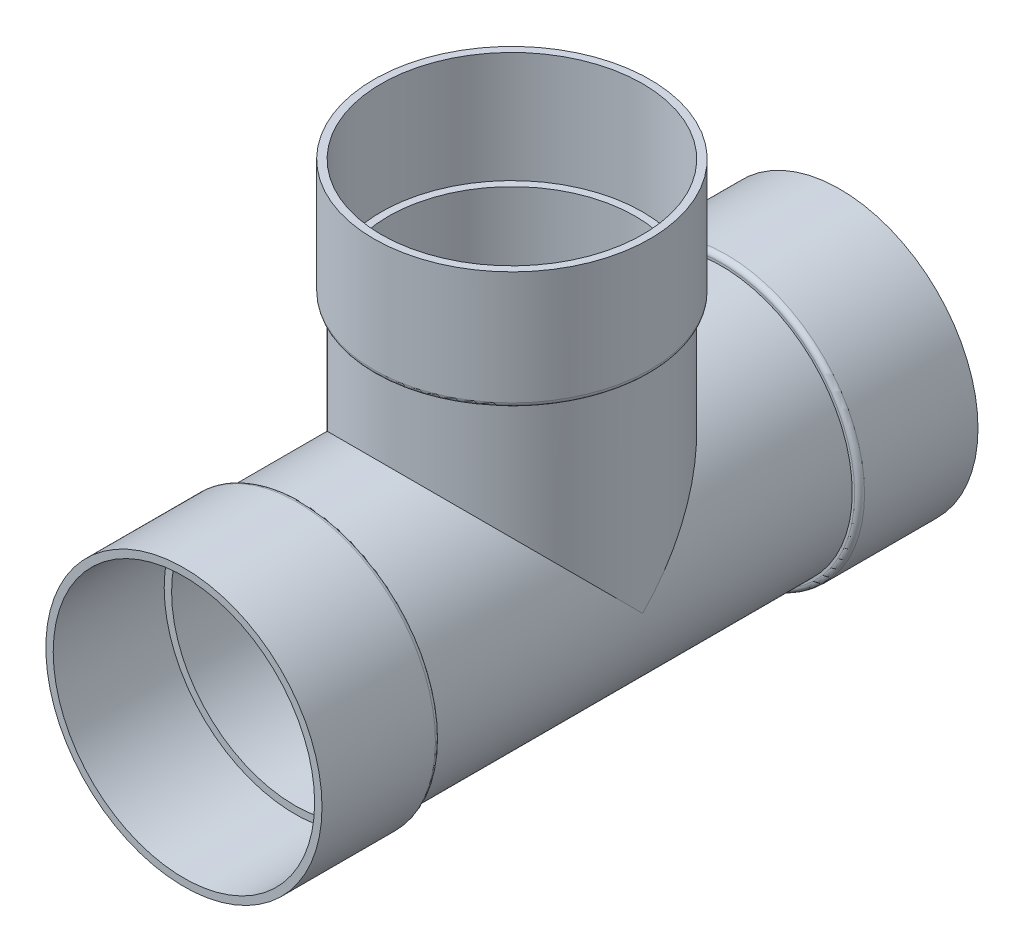
ISO-10303-21;
HEADER;
FILE_DESCRIPTION(('STEP AP214'),'2;1');
FILE_NAME('part.step','',(''),(''),'','','');
FILE_SCHEMA(('AUTOMOTIVE_DESIGN { 1 0 10303 214 1 1 1 1 }'));
ENDSEC;
DATA;
#1=APPLICATION_CONTEXT('core data for automotive mechanical design processes');
#2=APPLICATION_PROTOCOL_DEFINITION('international standard','automotive_design',2000,#1);
#3=PRODUCT_CONTEXT('',#1,'mechanical');
#4=PRODUCT('Part','Part','',(#3));
#5=PRODUCT_RELATED_PRODUCT_CATEGORY('part','',(#4));
#6=PRODUCT_DEFINITION_FORMATION('','',#4);
#7=PRODUCT_DEFINITION_CONTEXT('part definition',#1,'design');
#8=PRODUCT_DEFINITION('design','',#6,#7);
#9=PRODUCT_DEFINITION_SHAPE('','',#8);
#10=(LENGTH_UNIT() NAMED_UNIT(*) SI_UNIT(.MILLI.,.METRE.));
#11=(NAMED_UNIT(*) PLANE_ANGLE_UNIT() SI_UNIT($,.RADIAN.));
#12=(NAMED_UNIT(*) SI_UNIT($,.STERADIAN.) SOLID_ANGLE_UNIT());
#13=UNCERTAINTY_MEASURE_WITH_UNIT(LENGTH_MEASURE(1.E-05),#10,'distance_accuracy_value','');
#14=(GEOMETRIC_REPRESENTATION_CONTEXT(3) GLOBAL_UNCERTAINTY_ASSIGNED_CONTEXT((#13)) GLOBAL_UNIT_ASSIGNED_CONTEXT((#10,
#11,#12)) REPRESENTATION_CONTEXT('',''));
#15=CARTESIAN_POINT('',(0.,0.,0.));
#16=DIRECTION('',(0.,0.,1.));
#17=DIRECTION('',(1.,0.,0.));
#18=AXIS2_PLACEMENT_3D('',#15,#16,#17);
#19=CARTESIAN_POINT('',(0.,0.,211.1375));
#20=DIRECTION('',(0.,0.,-1.));
#21=DIRECTION('',(-1.,0.,0.));
#22=AXIS2_PLACEMENT_3D('',#19,#20,#21);
#23=PLANE('',#22);
#24=CARTESIAN_POINT('',(0.,0.,211.1375));
#25=DIRECTION('',(0.,0.,-1.));
#26=DIRECTION('',(-1.,0.,0.));
#27=AXIS2_PLACEMENT_3D('',#24,#25,#26);
#28=CIRCLE('',#27,84.1375);
#29=CARTESIAN_POINT('',(-84.1375,0.,211.1375));
#30=VERTEX_POINT('',#29);
#31=EDGE_CURVE('E243',#30,#30,#28,.F.);
#32=ORIENTED_EDGE('',*,*,#31,.F.);
#33=EDGE_LOOP('',(#32));
#34=FACE_BOUND('',#33,.T.);
#35=CARTESIAN_POINT('',(0.,0.,211.1375));
#36=DIRECTION('',(0.,0.,1.));
#37=DIRECTION('',(1.,0.,0.));
#38=AXIS2_PLACEMENT_3D('',#35,#36,#37);
#39=CIRCLE('',#38,88.8873);
#40=CARTESIAN_POINT('',(88.8873,0.,211.1375));
#41=VERTEX_POINT('',#40);
#42=EDGE_CURVE('E300',#41,#41,#39,.T.);
#43=ORIENTED_EDGE('',*,*,#42,.T.);
#44=EDGE_LOOP('',(#43));
#45=FACE_BOUND('',#44,.T.);
#46=ADVANCED_FACE('F203',(#34,#45),#23,.F.);
#47=CARTESIAN_POINT('',(0.,0.,168.70511138535));
#48=DIRECTION('',(0.,0.,1.));
#49=DIRECTION('',(1.,0.,0.));
#50=AXIS2_PLACEMENT_3D('',#47,#48,#49);
#51=CYLINDRICAL_SURFACE('',#50,88.8873);
#52=CARTESIAN_POINT('',(0.,0.,138.1125));
#53=DIRECTION('',(0.,0.,1.));
#54=DIRECTION('',(1.,0.,0.));
#55=AXIS2_PLACEMENT_3D('',#52,#53,#54);
#56=CIRCLE('',#55,88.8873);
#57=CARTESIAN_POINT('',(88.8873,0.,138.1125));
#58=VERTEX_POINT('',#57);
#59=EDGE_CURVE('E316',#58,#58,#56,.T.);
#60=ORIENTED_EDGE('',*,*,#59,.T.);
#61=EDGE_LOOP('',(#60));
#62=FACE_BOUND('',#61,.T.);
#63=ORIENTED_EDGE('',*,*,#42,.F.);
#64=EDGE_LOOP('',(#63));
#65=FACE_BOUND('',#64,.T.);
#66=ADVANCED_FACE('F341',(#62,#65),#51,.T.);
#67=CARTESIAN_POINT('',(0.,88.8873,134.9375));
#68=DIRECTION('',(0.,0.,1.));
#69=DIRECTION('',(1.,0.,0.));
#70=AXIS2_PLACEMENT_3D('',#67,#68,#69);
#71=PLANE('',#70);
#72=CARTESIAN_POINT('',(0.,0.,134.9375));
#73=DIRECTION('',(0.,0.,1.));
#74=DIRECTION('',(1.,0.,0.));
#75=AXIS2_PLACEMENT_3D('',#72,#73,#74);
#76=CIRCLE('',#75,85.7123);
#77=CARTESIAN_POINT('',(85.7123,0.,134.9375));
#78=VERTEX_POINT('',#77);
#79=EDGE_CURVE('E320',#78,#78,#76,.F.);
#80=ORIENTED_EDGE('',*,*,#79,.T.);
#81=EDGE_LOOP('',(#80));
#82=FACE_BOUND('',#81,.T.);
#83=CARTESIAN_POINT('',(0.,0.,134.9375));
#84=DIRECTION('',(0.,0.,1.));
#85=DIRECTION('',(1.,0.,0.));
#86=AXIS2_PLACEMENT_3D('',#83,#84,#85);
#87=CIRCLE('',#86,84.1375);
#88=CARTESIAN_POINT('',(84.1375,0.,134.9375));
#89=VERTEX_POINT('',#88);
#90=EDGE_CURVE('E296',#89,#89,#87,.T.);
#91=ORIENTED_EDGE('',*,*,#90,.T.);
#92=EDGE_LOOP('',(#91));
#93=FACE_BOUND('',#92,.T.);
#94=ADVANCED_FACE('F347',(#82,#93),#71,.F.);
#95=CARTESIAN_POINT('',(0.,0.,168.70511138535));
#96=DIRECTION('',(0.,0.,1.));
#97=DIRECTION('',(1.,0.,0.));
#98=AXIS2_PLACEMENT_3D('',#95,#96,#97);
#99=CYLINDRICAL_SURFACE('',#98,84.1375);
#100=CARTESIAN_POINT('',(0.,0.,0.));
#101=DIRECTION('',(0.,-0.707106781186547,0.707106781186547));
#102=DIRECTION('',(0.,0.707106781186547,0.707106781186547));
#103=AXIS2_PLACEMENT_3D('',#100,#101,#102);
#104=ELLIPSE('',#103,118.988393604166,84.1375);
#105=CARTESIAN_POINT('',(84.1375,0.,0.));
#106=VERTEX_POINT('',#105);
#107=CARTESIAN_POINT('',(-84.1375,0.,0.));
#108=VERTEX_POINT('',#107);
#109=EDGE_CURVE('E226',#106,#108,#104,.T.);
#110=ORIENTED_EDGE('',*,*,#109,.T.);
#111=CARTESIAN_POINT('',(0.,0.,0.));
#112=DIRECTION('',(0.,0.707106781186547,0.707106781186547));
#113=DIRECTION('',(0.,-0.707106781186547,0.707106781186547));
#114=AXIS2_PLACEMENT_3D('',#111,#112,#113);
#115=ELLIPSE('',#114,118.988393604166,84.1375);
#116=EDGE_CURVE('E221',#108,#106,#115,.F.);
#117=ORIENTED_EDGE('',*,*,#116,.T.);
#118=EDGE_LOOP('',(#110,#117));
#119=FACE_BOUND('',#118,.T.);
#120=ORIENTED_EDGE('',*,*,#90,.F.);
#121=EDGE_LOOP('',(#120));
#122=FACE_BOUND('',#121,.T.);
#123=CARTESIAN_POINT('',(0.,0.,-134.9375));
#124=DIRECTION('',(0.,0.,1.));
#125=DIRECTION('',(1.,0.,0.));
#126=AXIS2_PLACEMENT_3D('',#123,#124,#125);
#127=CIRCLE('',#126,84.1375);
#128=CARTESIAN_POINT('',(84.1375,0.,-134.9375));
#129=VERTEX_POINT('',#128);
#130=EDGE_CURVE('E292',#129,#129,#127,.T.);
#131=ORIENTED_EDGE('',*,*,#130,.T.);
#132=EDGE_LOOP('',(#131));
#133=FACE_BOUND('',#132,.T.);
#134=ADVANCED_FACE('F371',(#119,#122,#133),#99,.T.);
#135=CARTESIAN_POINT('',(0.,88.8873,-134.9375));
#136=DIRECTION('',(0.,0.,-1.));
#137=DIRECTION('',(-1.,0.,0.));
#138=AXIS2_PLACEMENT_3D('',#135,#136,#137);
#139=PLANE('',#138);
#140=CARTESIAN_POINT('',(0.,0.,-134.9375));
#141=DIRECTION('',(0.,0.,-1.));
#142=DIRECTION('',(-1.,0.,0.));
#143=AXIS2_PLACEMENT_3D('',#140,#141,#142);
#144=CIRCLE('',#143,85.7123);
#145=CARTESIAN_POINT('',(-85.7123,0.,-134.9375));
#146=VERTEX_POINT('',#145);
#147=EDGE_CURVE('E308',#146,#146,#144,.F.);
#148=ORIENTED_EDGE('',*,*,#147,.T.);
#149=EDGE_LOOP('',(#148));
#150=FACE_BOUND('',#149,.T.);
#151=ORIENTED_EDGE('',*,*,#130,.F.);
#152=EDGE_LOOP('',(#151));
#153=FACE_BOUND('',#152,.T.);
#154=ADVANCED_FACE('F367',(#150,#153),#139,.F.);
#155=CARTESIAN_POINT('',(0.,0.,168.70511138535));
#156=DIRECTION('',(0.,0.,1.));
#157=DIRECTION('',(1.,0.,0.));
#158=AXIS2_PLACEMENT_3D('',#155,#156,#157);
#159=CYLINDRICAL_SURFACE('',#158,88.8873);
#160=CARTESIAN_POINT('',(0.,0.,-138.1125));
#161=DIRECTION('',(0.,0.,-1.));
#162=DIRECTION('',(-1.,0.,0.));
#163=AXIS2_PLACEMENT_3D('',#160,#161,#162);
#164=CIRCLE('',#163,88.8873);
#165=CARTESIAN_POINT('',(-88.8873,0.,-138.1125));
#166=VERTEX_POINT('',#165);
#167=EDGE_CURVE('E312',#166,#166,#164,.T.);
#168=ORIENTED_EDGE('',*,*,#167,.T.);
#169=EDGE_LOOP('',(#168));
#170=FACE_BOUND('',#169,.T.);
#171=CARTESIAN_POINT('',(0.,0.,-211.1375));
#172=DIRECTION('',(0.,0.,1.));
#173=DIRECTION('',(1.,0.,0.));
#174=AXIS2_PLACEMENT_3D('',#171,#172,#173);
#175=CIRCLE('',#174,88.8873);
#176=CARTESIAN_POINT('',(88.8873,0.,-211.1375));
#177=VERTEX_POINT('',#176);
#178=EDGE_CURVE('E288',#177,#177,#175,.T.);
#179=ORIENTED_EDGE('',*,*,#178,.T.);
#180=EDGE_LOOP('',(#179));
#181=FACE_BOUND('',#180,.T.);
#182=ADVANCED_FACE('F370',(#170,#181),#159,.T.);
#183=CARTESIAN_POINT('',(0.,88.8873,-211.1375));
#184=DIRECTION('',(0.,0.,1.));
#185=DIRECTION('',(1.,0.,0.));
#186=AXIS2_PLACEMENT_3D('',#183,#184,#185);
#187=PLANE('',#186);
#188=CARTESIAN_POINT('',(0.,0.,-211.1375));
#189=DIRECTION('',(0.,0.,1.));
#190=DIRECTION('',(1.,0.,0.));
#191=AXIS2_PLACEMENT_3D('',#188,#189,#190);
#192=CIRCLE('',#191,84.1375);
#193=CARTESIAN_POINT('',(84.1375,0.,-211.1375));
#194=VERTEX_POINT('',#193);
#195=EDGE_CURVE('E265',#194,#194,#192,.T.);
#196=ORIENTED_EDGE('',*,*,#195,.T.);
#197=EDGE_LOOP('',(#196));
#198=FACE_BOUND('',#197,.T.);
#199=ORIENTED_EDGE('',*,*,#178,.F.);
#200=EDGE_LOOP('',(#199));
#201=FACE_BOUND('',#200,.T.);
#202=ADVANCED_FACE('F386',(#198,#201),#187,.F.);
#203=CARTESIAN_POINT('',(0.,0.,0.));
#204=DIRECTION('',(0.,1.,0.));
#205=DIRECTION('',(0.,0.,1.));
#206=AXIS2_PLACEMENT_3D('',#203,#204,#205);
#207=CYLINDRICAL_SURFACE('',#206,84.1375);
#208=CARTESIAN_POINT('',(0.,134.9375,0.));
#209=DIRECTION('',(0.,1.,0.));
#210=DIRECTION('',(0.,0.,1.));
#211=AXIS2_PLACEMENT_3D('',#208,#209,#210);
#212=CIRCLE('',#211,84.1375);
#213=CARTESIAN_POINT('',(0.,134.9375,84.1375));
#214=VERTEX_POINT('',#213);
#215=EDGE_CURVE('E247',#214,#214,#212,.T.);
#216=ORIENTED_EDGE('',*,*,#215,.F.);
#217=EDGE_LOOP('',(#216));
#218=FACE_BOUND('',#217,.T.);
#219=ORIENTED_EDGE('',*,*,#116,.F.);
#220=ORIENTED_EDGE('',*,*,#109,.F.);
#221=EDGE_LOOP('',(#219,#220));
#222=FACE_BOUND('',#221,.T.);
#223=ADVANCED_FACE('F390',(#218,#222),#207,.T.);
#224=CARTESIAN_POINT('',(0.,211.1375,0.));
#225=DIRECTION('',(0.,1.,0.));
#226=DIRECTION('',(0.,0.,1.));
#227=AXIS2_PLACEMENT_3D('',#224,#225,#226);
#228=PLANE('',#227);
#229=CARTESIAN_POINT('',(0.,211.1375,0.));
#230=DIRECTION('',(0.,1.,0.));
#231=DIRECTION('',(0.,0.,1.));
#232=AXIS2_PLACEMENT_3D('',#229,#230,#231);
#233=CIRCLE('',#232,84.1375);
#234=CARTESIAN_POINT('',(0.,211.1375,84.1375));
#235=VERTEX_POINT('',#234);
#236=EDGE_CURVE('E274',#235,#235,#233,.T.);
#237=ORIENTED_EDGE('',*,*,#236,.F.);
#238=EDGE_LOOP('',(#237));
#239=FACE_BOUND('',#238,.T.);
#240=CARTESIAN_POINT('',(0.,211.1375,0.));
#241=DIRECTION('',(0.,1.,0.));
#242=DIRECTION('',(0.,0.,1.));
#243=AXIS2_PLACEMENT_3D('',#240,#241,#242);
#244=CIRCLE('',#243,88.8873);
#245=CARTESIAN_POINT('',(0.,211.1375,88.8873));
#246=VERTEX_POINT('',#245);
#247=EDGE_CURVE('E252',#246,#246,#244,.T.);
#248=ORIENTED_EDGE('',*,*,#247,.T.);
#249=EDGE_LOOP('',(#248));
#250=FACE_BOUND('',#249,.T.);
#251=ADVANCED_FACE('F392',(#239,#250),#228,.T.);
#252=CARTESIAN_POINT('',(0.,0.,0.));
#253=DIRECTION('',(0.,1.,0.));
#254=DIRECTION('',(0.,0.,1.));
#255=AXIS2_PLACEMENT_3D('',#252,#253,#254);
#256=CYLINDRICAL_SURFACE('',#255,88.8873);
#257=CARTESIAN_POINT('',(0.,138.1125,0.));
#258=DIRECTION('',(0.,-1.,0.));
#259=DIRECTION('',(0.,0.,-1.));
#260=AXIS2_PLACEMENT_3D('',#257,#258,#259);
#261=CIRCLE('',#260,88.8873);
#262=CARTESIAN_POINT('',(0.,138.1125,-88.8873));
#263=VERTEX_POINT('',#262);
#264=EDGE_CURVE('E212',#263,#263,#261,.F.);
#265=ORIENTED_EDGE('',*,*,#264,.T.);
#266=EDGE_LOOP('',(#265));
#267=FACE_BOUND('',#266,.T.);
#268=ORIENTED_EDGE('',*,*,#247,.F.);
#269=EDGE_LOOP('',(#268));
#270=FACE_BOUND('',#269,.T.);
#271=ADVANCED_FACE('F328',(#267,#270),#256,.T.);
#272=CARTESIAN_POINT('',(0.,134.9375,88.8873));
#273=DIRECTION('',(0.,-1.,0.));
#274=DIRECTION('',(0.,0.,-1.));
#275=AXIS2_PLACEMENT_3D('',#272,#273,#274);
#276=PLANE('',#275);
#277=CARTESIAN_POINT('',(0.,134.9375,0.));
#278=DIRECTION('',(0.,-1.,0.));
#279=DIRECTION('',(0.,0.,-1.));
#280=AXIS2_PLACEMENT_3D('',#277,#278,#279);
#281=CIRCLE('',#280,85.7123);
#282=CARTESIAN_POINT('',(0.,134.9375,-85.7123));
#283=VERTEX_POINT('',#282);
#284=EDGE_CURVE('E14',#283,#283,#281,.T.);
#285=ORIENTED_EDGE('',*,*,#284,.T.);
#286=EDGE_LOOP('',(#285));
#287=FACE_BOUND('',#286,.T.);
#288=ORIENTED_EDGE('',*,*,#215,.T.);
#289=EDGE_LOOP('',(#288));
#290=FACE_BOUND('',#289,.T.);
#291=ADVANCED_FACE('F398',(#287,#290),#276,.T.);
#292=CARTESIAN_POINT('',(0.,0.,168.70511138535));
#293=DIRECTION('',(0.,0.,1.));
#294=DIRECTION('',(1.,0.,0.));
#295=AXIS2_PLACEMENT_3D('',#292,#293,#294);
#296=CYLINDRICAL_SURFACE('',#295,84.1375);
#297=ORIENTED_EDGE('',*,*,#31,.T.);
#298=EDGE_LOOP('',(#297));
#299=FACE_BOUND('',#298,.T.);
#300=CARTESIAN_POINT('',(0.,0.,139.6873));
#301=DIRECTION('',(0.,0.,1.));
#302=DIRECTION('',(1.,0.,0.));
#303=AXIS2_PLACEMENT_3D('',#300,#301,#302);
#304=CIRCLE('',#303,84.1375);
#305=CARTESIAN_POINT('',(84.1375,0.,139.6873));
#306=VERTEX_POINT('',#305);
#307=EDGE_CURVE('E278',#306,#306,#304,.T.);
#308=ORIENTED_EDGE('',*,*,#307,.F.);
#309=EDGE_LOOP('',(#308));
#310=FACE_BOUND('',#309,.T.);
#311=ADVANCED_FACE('F401',(#299,#310),#296,.F.);
#312=CARTESIAN_POINT('',(0.,88.8873,139.6873));
#313=DIRECTION('',(0.,0.,1.));
#314=DIRECTION('',(1.,0.,0.));
#315=AXIS2_PLACEMENT_3D('',#312,#313,#314);
#316=PLANE('',#315);
#317=ORIENTED_EDGE('',*,*,#307,.T.);
#318=EDGE_LOOP('',(#317));
#319=FACE_BOUND('',#318,.T.);
#320=CARTESIAN_POINT('',(0.,0.,139.6873));
#321=DIRECTION('',(0.,0.,1.));
#322=DIRECTION('',(1.,0.,0.));
#323=AXIS2_PLACEMENT_3D('',#320,#321,#322);
#324=CIRCLE('',#323,79.3877);
#325=CARTESIAN_POINT('',(79.3877,0.,139.6873));
#326=VERTEX_POINT('',#325);
#327=EDGE_CURVE('E260',#326,#326,#324,.T.);
#328=ORIENTED_EDGE('',*,*,#327,.F.);
#329=EDGE_LOOP('',(#328));
#330=FACE_BOUND('',#329,.T.);
#331=ADVANCED_FACE('F422',(#319,#330),#316,.T.);
#332=CARTESIAN_POINT('',(0.,0.,168.70511138535));
#333=DIRECTION('',(0.,0.,1.));
#334=DIRECTION('',(1.,0.,0.));
#335=AXIS2_PLACEMENT_3D('',#332,#333,#334);
#336=CYLINDRICAL_SURFACE('',#335,79.3877);
#337=CARTESIAN_POINT('',(0.,0.,0.));
#338=DIRECTION('',(0.,-0.707106781186547,0.707106781186547));
#339=DIRECTION('',(0.,0.707106781186547,0.707106781186547));
#340=AXIS2_PLACEMENT_3D('',#337,#338,#339);
#341=ELLIPSE('',#340,112.271162025607,79.3877);
#342=CARTESIAN_POINT('',(79.3877,0.,0.));
#343=VERTEX_POINT('',#342);
#344=CARTESIAN_POINT('',(-79.3877,0.,0.));
#345=VERTEX_POINT('',#344);
#346=EDGE_CURVE('E236',#343,#345,#341,.T.);
#347=ORIENTED_EDGE('',*,*,#346,.F.);
#348=CARTESIAN_POINT('',(0.,0.,0.));
#349=DIRECTION('',(0.,0.707106781186547,0.707106781186547));
#350=DIRECTION('',(0.,-0.707106781186547,0.707106781186547));
#351=AXIS2_PLACEMENT_3D('',#348,#349,#350);
#352=ELLIPSE('',#351,112.271162025607,79.3877);
#353=EDGE_CURVE('E240',#345,#343,#352,.F.);
#354=ORIENTED_EDGE('',*,*,#353,.F.);
#355=EDGE_LOOP('',(#347,#354));
#356=FACE_BOUND('',#355,.T.);
#357=ORIENTED_EDGE('',*,*,#327,.T.);
#358=EDGE_LOOP('',(#357));
#359=FACE_BOUND('',#358,.T.);
#360=CARTESIAN_POINT('',(0.,0.,-139.6873));
#361=DIRECTION('',(0.,0.,-1.));
#362=DIRECTION('',(-1.,0.,0.));
#363=AXIS2_PLACEMENT_3D('',#360,#361,#362);
#364=CIRCLE('',#363,79.3877);
#365=CARTESIAN_POINT('',(-79.3877,0.,-139.6873));
#366=VERTEX_POINT('',#365);
#367=EDGE_CURVE('E256',#366,#366,#364,.F.);
#368=ORIENTED_EDGE('',*,*,#367,.F.);
#369=EDGE_LOOP('',(#368));
#370=FACE_BOUND('',#369,.T.);
#371=ADVANCED_FACE('F238',(#356,#359,#370),#336,.F.);
#372=CARTESIAN_POINT('',(0.,88.8873,-139.6873));
#373=DIRECTION('',(0.,0.,-1.));
#374=DIRECTION('',(-1.,0.,0.));
#375=AXIS2_PLACEMENT_3D('',#372,#373,#374);
#376=PLANE('',#375);
#377=ORIENTED_EDGE('',*,*,#367,.T.);
#378=EDGE_LOOP('',(#377));
#379=FACE_BOUND('',#378,.T.);
#380=CARTESIAN_POINT('',(0.,0.,-139.6873));
#381=DIRECTION('',(0.,0.,-1.));
#382=DIRECTION('',(-1.,0.,0.));
#383=AXIS2_PLACEMENT_3D('',#380,#381,#382);
#384=CIRCLE('',#383,84.1375);
#385=CARTESIAN_POINT('',(-84.1375,0.,-139.6873));
#386=VERTEX_POINT('',#385);
#387=EDGE_CURVE('E261',#386,#386,#384,.F.);
#388=ORIENTED_EDGE('',*,*,#387,.F.);
#389=EDGE_LOOP('',(#388));
#390=FACE_BOUND('',#389,.T.);
#391=ADVANCED_FACE('F415',(#379,#390),#376,.T.);
#392=CARTESIAN_POINT('',(0.,0.,168.70511138535));
#393=DIRECTION('',(0.,0.,1.));
#394=DIRECTION('',(1.,0.,0.));
#395=AXIS2_PLACEMENT_3D('',#392,#393,#394);
#396=CYLINDRICAL_SURFACE('',#395,84.1375);
#397=ORIENTED_EDGE('',*,*,#387,.T.);
#398=EDGE_LOOP('',(#397));
#399=FACE_BOUND('',#398,.T.);
#400=ORIENTED_EDGE('',*,*,#195,.F.);
#401=EDGE_LOOP('',(#400));
#402=FACE_BOUND('',#401,.T.);
#403=ADVANCED_FACE('F411',(#399,#402),#396,.F.);
#404=CARTESIAN_POINT('',(0.,0.,0.));
#405=DIRECTION('',(0.,1.,0.));
#406=DIRECTION('',(0.,0.,1.));
#407=AXIS2_PLACEMENT_3D('',#404,#405,#406);
#408=CYLINDRICAL_SURFACE('',#407,79.3877);
#409=CARTESIAN_POINT('',(0.,139.6873,0.));
#410=DIRECTION('',(0.,-1.,0.));
#411=DIRECTION('',(0.,0.,-1.));
#412=AXIS2_PLACEMENT_3D('',#409,#410,#411);
#413=CIRCLE('',#412,79.3877);
#414=CARTESIAN_POINT('',(0.,139.6873,-79.3877));
#415=VERTEX_POINT('',#414);
#416=EDGE_CURVE('E266',#415,#415,#413,.F.);
#417=ORIENTED_EDGE('',*,*,#416,.T.);
#418=EDGE_LOOP('',(#417));
#419=FACE_BOUND('',#418,.T.);
#420=ORIENTED_EDGE('',*,*,#353,.T.);
#421=ORIENTED_EDGE('',*,*,#346,.T.);
#422=EDGE_LOOP('',(#420,#421));
#423=FACE_BOUND('',#422,.T.);
#424=ADVANCED_FACE('F245',(#419,#423),#408,.F.);
#425=CARTESIAN_POINT('',(0.,0.,0.));
#426=DIRECTION('',(0.,1.,0.));
#427=DIRECTION('',(0.,0.,1.));
#428=AXIS2_PLACEMENT_3D('',#425,#426,#427);
#429=CYLINDRICAL_SURFACE('',#428,84.1375);
#430=CARTESIAN_POINT('',(0.,139.6873,0.));
#431=DIRECTION('',(0.,-1.,0.));
#432=DIRECTION('',(0.,0.,-1.));
#433=AXIS2_PLACEMENT_3D('',#430,#431,#432);
#434=CIRCLE('',#433,84.1375);
#435=CARTESIAN_POINT('',(0.,139.6873,-84.1375));
#436=VERTEX_POINT('',#435);
#437=EDGE_CURVE('E270',#436,#436,#434,.F.);
#438=ORIENTED_EDGE('',*,*,#437,.F.);
#439=EDGE_LOOP('',(#438));
#440=FACE_BOUND('',#439,.T.);
#441=ORIENTED_EDGE('',*,*,#236,.T.);
#442=EDGE_LOOP('',(#441));
#443=FACE_BOUND('',#442,.T.);
#444=ADVANCED_FACE('F360',(#440,#443),#429,.F.);
#445=CARTESIAN_POINT('',(0.,139.6873,88.8873));
#446=DIRECTION('',(0.,-1.,0.));
#447=DIRECTION('',(0.,0.,-1.));
#448=AXIS2_PLACEMENT_3D('',#445,#446,#447);
#449=PLANE('',#448);
#450=ORIENTED_EDGE('',*,*,#416,.F.);
#451=EDGE_LOOP('',(#450));
#452=FACE_BOUND('',#451,.T.);
#453=ORIENTED_EDGE('',*,*,#437,.T.);
#454=EDGE_LOOP('',(#453));
#455=FACE_BOUND('',#454,.T.);
#456=ADVANCED_FACE('F355',(#452,#455),#449,.F.);
#457=CARTESIAN_POINT('',(0.,0.,-138.1125));
#458=DIRECTION('',(0.,0.,-1.));
#459=DIRECTION('',(-1.,0.,0.));
#460=AXIS2_PLACEMENT_3D('',#457,#458,#459);
#461=TOROIDAL_SURFACE('',#460,85.7123,3.175);
#462=ORIENTED_EDGE('',*,*,#167,.F.);
#463=EDGE_LOOP('',(#462));
#464=FACE_BOUND('',#463,.T.);
#465=ORIENTED_EDGE('',*,*,#147,.F.);
#466=EDGE_LOOP('',(#465));
#467=FACE_BOUND('',#466,.T.);
#468=ADVANCED_FACE('F337',(#464,#467),#461,.T.);
#469=CARTESIAN_POINT('',(0.,0.,138.1125));
#470=DIRECTION('',(0.,0.,1.));
#471=DIRECTION('',(1.,0.,0.));
#472=AXIS2_PLACEMENT_3D('',#469,#470,#471);
#473=TOROIDAL_SURFACE('',#472,85.7123,3.175);
#474=ORIENTED_EDGE('',*,*,#79,.F.);
#475=EDGE_LOOP('',(#474));
#476=FACE_BOUND('',#475,.T.);
#477=ORIENTED_EDGE('',*,*,#59,.F.);
#478=EDGE_LOOP('',(#477));
#479=FACE_BOUND('',#478,.T.);
#480=ADVANCED_FACE('F332',(#476,#479),#473,.T.);
#481=CARTESIAN_POINT('',(0.,138.1125,0.));
#482=DIRECTION('',(0.,-1.,0.));
#483=DIRECTION('',(0.,0.,-1.));
#484=AXIS2_PLACEMENT_3D('',#481,#482,#483);
#485=TOROIDAL_SURFACE('',#484,85.7123,3.175);
#486=ORIENTED_EDGE('',*,*,#284,.F.);
#487=EDGE_LOOP('',(#486));
#488=FACE_BOUND('',#487,.T.);
#489=ORIENTED_EDGE('',*,*,#264,.F.);
#490=EDGE_LOOP('',(#489));
#491=FACE_BOUND('',#490,.T.);
#492=ADVANCED_FACE('F205',(#488,#491),#485,.T.);
#493=CLOSED_SHELL('',(#46,#66,#94,#134,#154,#182,#202,#223,#251,#271,#291,#311,#331,#371,#391,
#403,#424,#444,#456,#468,#480,#492));
#494=MANIFOLD_SOLID_BREP('B2',#493);
#495=ADVANCED_BREP_SHAPE_REPRESENTATION('',(#18,#494),#14);
#496=SHAPE_DEFINITION_REPRESENTATION(#9,#495);
ENDSEC;
END-ISO-10303-21;
